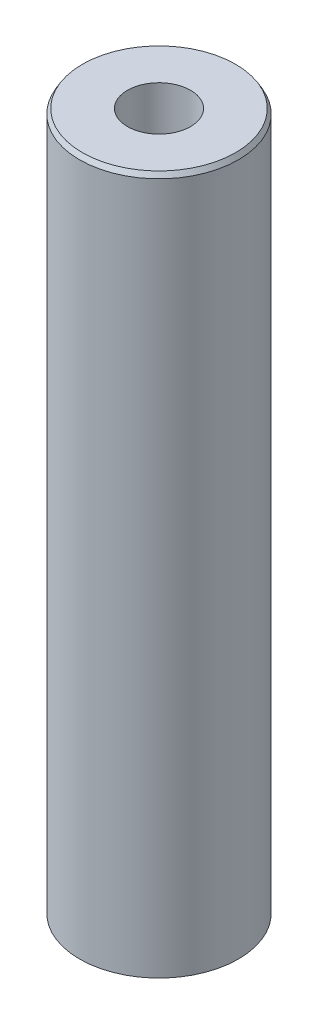
ISO-10303-21;
HEADER;
FILE_DESCRIPTION(('STEP AP214'),'2;1');
FILE_NAME('part.step','',(''),(''),'','','');
FILE_SCHEMA(('AUTOMOTIVE_DESIGN { 1 0 10303 214 1 1 1 1 }'));
ENDSEC;
DATA;
#1=APPLICATION_CONTEXT('core data for automotive mechanical design processes');
#2=APPLICATION_PROTOCOL_DEFINITION('international standard','automotive_design',2000,#1);
#3=PRODUCT_CONTEXT('',#1,'mechanical');
#4=PRODUCT('Part','Part','',(#3));
#5=PRODUCT_RELATED_PRODUCT_CATEGORY('part','',(#4));
#6=PRODUCT_DEFINITION_FORMATION('','',#4);
#7=PRODUCT_DEFINITION_CONTEXT('part definition',#1,'design');
#8=PRODUCT_DEFINITION('design','',#6,#7);
#9=PRODUCT_DEFINITION_SHAPE('','',#8);
#10=(LENGTH_UNIT() NAMED_UNIT(*) SI_UNIT(.MILLI.,.METRE.));
#11=(NAMED_UNIT(*) PLANE_ANGLE_UNIT() SI_UNIT($,.RADIAN.));
#12=(NAMED_UNIT(*) SI_UNIT($,.STERADIAN.) SOLID_ANGLE_UNIT());
#13=UNCERTAINTY_MEASURE_WITH_UNIT(LENGTH_MEASURE(1.E-05),#10,'distance_accuracy_value','');
#14=(GEOMETRIC_REPRESENTATION_CONTEXT(3) GLOBAL_UNCERTAINTY_ASSIGNED_CONTEXT((#13)) GLOBAL_UNIT_ASSIGNED_CONTEXT((#10,
#11,#12)) REPRESENTATION_CONTEXT('',''));
#15=CARTESIAN_POINT('',(0.,0.,0.));
#16=DIRECTION('',(0.,0.,1.));
#17=DIRECTION('',(1.,0.,0.));
#18=AXIS2_PLACEMENT_3D('',#15,#16,#17);
#19=CARTESIAN_POINT('',(0.,418.697580881328,0.));
#20=DIRECTION('',(0.,-1.,0.));
#21=DIRECTION('',(0.,0.,-1.));
#22=AXIS2_PLACEMENT_3D('',#19,#20,#21);
#23=CYLINDRICAL_SURFACE('',#22,47.5);
#24=CARTESIAN_POINT('',(0.,415.809712659782,0.));
#25=DIRECTION('',(0.,1.,0.));
#26=DIRECTION('',(0.,0.,1.));
#27=AXIS2_PLACEMENT_3D('',#24,#25,#26);
#28=CIRCLE('',#27,47.5);
#29=CARTESIAN_POINT('',(0.,415.809712659782,-47.5));
#30=VERTEX_POINT('',#29);
#31=EDGE_CURVE('E50',#30,#30,#28,.F.);
#32=CARTESIAN_POINT('',(0.,1.66731149509403,0.));
#33=DIRECTION('',(0.,1.,0.));
#34=DIRECTION('',(0.,0.,1.));
#35=AXIS2_PLACEMENT_3D('',#32,#33,#34);
#36=CIRCLE('',#35,47.5);
#37=CARTESIAN_POINT('',(0.,1.66731149509397,-47.5));
#38=VERTEX_POINT('',#37);
#39=EDGE_CURVE('E51',#38,#38,#36,.T.);
#40=CARTESIAN_POINT('',(0.,415.809712659782,-47.5));
#41=CARTESIAN_POINT('',(0.,411.495729314317,-47.5));
#42=CARTESIAN_POINT('',(0.,407.181745968851,-47.5));
#43=CARTESIAN_POINT('',(0.,398.55377927792,-47.5));
#44=CARTESIAN_POINT('',(0.,394.239795932455,-47.5));
#45=CARTESIAN_POINT('',(0.,385.611829241524,-47.5));
#46=CARTESIAN_POINT('',(0.,381.297845896058,-47.5));
#47=CARTESIAN_POINT('',(0.,372.669879205127,-47.5));
#48=CARTESIAN_POINT('',(0.,368.355895859662,-47.5));
#49=CARTESIAN_POINT('',(0.,359.727929168731,-47.5));
#50=CARTESIAN_POINT('',(0.,355.413945823265,-47.5));
#51=CARTESIAN_POINT('',(0.,346.785979132334,-47.5));
#52=CARTESIAN_POINT('',(0.,342.471995786869,-47.5));
#53=CARTESIAN_POINT('',(0.,333.844029095938,-47.5));
#54=CARTESIAN_POINT('',(0.,329.530045750472,-47.5));
#55=CARTESIAN_POINT('',(0.,320.902079059541,-47.5));
#56=CARTESIAN_POINT('',(0.,316.588095714076,-47.5));
#57=CARTESIAN_POINT('',(0.,307.960129023145,-47.5));
#58=CARTESIAN_POINT('',(0.,303.646145677679,-47.5));
#59=CARTESIAN_POINT('',(0.,295.018178986748,-47.5));
#60=CARTESIAN_POINT('',(0.,290.704195641283,-47.5));
#61=CARTESIAN_POINT('',(0.,282.076228950352,-47.5));
#62=CARTESIAN_POINT('',(0.,277.762245604886,-47.5));
#63=CARTESIAN_POINT('',(0.,269.134278913955,-47.5));
#64=CARTESIAN_POINT('',(0.,264.82029556849,-47.5));
#65=CARTESIAN_POINT('',(0.,256.192328877559,-47.5));
#66=CARTESIAN_POINT('',(0.,251.878345532093,-47.5));
#67=CARTESIAN_POINT('',(0.,243.250378841162,-47.5));
#68=CARTESIAN_POINT('',(0.,238.936395495697,-47.5));
#69=CARTESIAN_POINT('',(0.,230.308428804766,-47.5));
#70=CARTESIAN_POINT('',(0.,225.9944454593,-47.5));
#71=CARTESIAN_POINT('',(0.,217.366478768369,-47.5));
#72=CARTESIAN_POINT('',(0.,213.052495422904,-47.5));
#73=CARTESIAN_POINT('',(0.,204.424528731973,-47.5));
#74=CARTESIAN_POINT('',(0.,200.110545386507,-47.5));
#75=CARTESIAN_POINT('',(0.,191.482578695576,-47.5));
#76=CARTESIAN_POINT('',(0.,187.168595350111,-47.5));
#77=CARTESIAN_POINT('',(0.,178.54062865918,-47.5));
#78=CARTESIAN_POINT('',(0.,174.226645313714,-47.5));
#79=CARTESIAN_POINT('',(0.,165.598678622783,-47.5));
#80=CARTESIAN_POINT('',(0.,161.284695277318,-47.5));
#81=CARTESIAN_POINT('',(0.,152.656728586387,-47.5));
#82=CARTESIAN_POINT('',(0.,148.342745240921,-47.5));
#83=CARTESIAN_POINT('',(0.,139.71477854999,-47.5));
#84=CARTESIAN_POINT('',(0.,135.400795204525,-47.5));
#85=CARTESIAN_POINT('',(0.,126.772828513594,-47.5));
#86=CARTESIAN_POINT('',(0.,122.458845168128,-47.5));
#87=CARTESIAN_POINT('',(0.,113.830878477197,-47.5));
#88=CARTESIAN_POINT('',(0.,109.516895131732,-47.5));
#89=CARTESIAN_POINT('',(0.,100.888928440801,-47.5));
#90=CARTESIAN_POINT('',(0.,96.574945095335,-47.5));
#91=CARTESIAN_POINT('',(0.,87.946978404404,-47.5));
#92=CARTESIAN_POINT('',(0.,83.6329950589385,-47.5));
#93=CARTESIAN_POINT('',(0.,75.0050283680075,-47.5));
#94=CARTESIAN_POINT('',(0.,70.691045022542,-47.5));
#95=CARTESIAN_POINT('',(0.,62.063078331611,-47.5));
#96=CARTESIAN_POINT('',(0.,57.7490949861455,-47.5));
#97=CARTESIAN_POINT('',(0.,49.1211282952145,-47.5));
#98=CARTESIAN_POINT('',(0.,44.807144949749,-47.5));
#99=CARTESIAN_POINT('',(0.,36.179178258818,-47.5));
#100=CARTESIAN_POINT('',(0.,31.8651949133525,-47.5));
#101=CARTESIAN_POINT('',(0.,23.2372282224215,-47.5));
#102=CARTESIAN_POINT('',(0.,18.923244876956,-47.5));
#103=CARTESIAN_POINT('',(0.,10.295278186025,-47.5));
#104=CARTESIAN_POINT('',(0.,5.98129484055948,-47.5));
#105=CARTESIAN_POINT('',(0.,1.66731149509397,-47.5));
#106=B_SPLINE_CURVE_WITH_KNOTS('',3,(#40,#41,#42,#43,#44,#45,#46,#47,#48,#49,#50,#51,#52,#53,
#54,#55,#56,#57,#58,#59,#60,#61,#62,#63,#64,#65,#66,#67,#68,#69,#70,#71,#72,#73,#74,#75,#76,#77,
#78,#79,#80,#81,#82,#83,#84,#85,#86,#87,#88,#89,#90,#91,#92,#93,#94,#95,#96,#97,#98,#99,#100,
#101,#102,#103,#104,#105),.UNSPECIFIED.,.F.,.F.,(4,2,2,2,2,2,2,2,2,2,2,2,2,2,2,2,2,2,2,2,2,2,2,
2,2,2,2,2,2,2,2,2,4),(0.,12.9419500363965,25.883900072793,38.8258501091895,51.767800145586,
64.7097501819825,77.651700218379,90.5936502547755,103.535600291172,116.477550327569,
129.419500363965,142.361450400362,155.303400436758,168.245350473155,181.187300509551,
194.129250545948,207.071200582344,220.013150618741,232.955100655137,245.897050691534,
258.83900072793,271.780950764327,284.722900800723,297.66485083712,310.606800873516,
323.548750909913,336.490700946309,349.432650982706,362.374601019102,375.316551055499,
388.258501091895,401.200451128292,414.142401164688),.UNSPECIFIED.);
#107=EDGE_CURVE('BSEAM39',#30,#38,#106,.T.);
#108=ORIENTED_EDGE('',*,*,#31,.T.);
#109=ORIENTED_EDGE('',*,*,#39,.T.);
#110=ORIENTED_EDGE('',*,*,#107,.T.);
#111=ORIENTED_EDGE('',*,*,#107,.F.);
#112=EDGE_LOOP('',(#108,#110,#109,#111));
#113=FACE_BOUND('',#112,.T.);
#114=ADVANCED_FACE('F39',(#113),#23,.T.);
#115=CARTESIAN_POINT('',(0.,418.697580881328,0.));
#116=DIRECTION('',(0.,1.,0.));
#117=DIRECTION('',(0.,0.,1.));
#118=AXIS2_PLACEMENT_3D('',#115,#116,#117);
#119=PLANE('',#118);
#120=CARTESIAN_POINT('',(0.,418.697580881328,0.));
#121=DIRECTION('',(0.,1.,0.));
#122=DIRECTION('',(0.,0.,1.));
#123=AXIS2_PLACEMENT_3D('',#120,#121,#122);
#124=CIRCLE('',#123,45.8326885049065);
#125=CARTESIAN_POINT('',(0.,418.697580881328,45.8326885049065));
#126=VERTEX_POINT('',#125);
#127=EDGE_CURVE('E54',#126,#126,#124,.T.);
#128=ORIENTED_EDGE('',*,*,#127,.T.);
#129=EDGE_LOOP('',(#128));
#130=FACE_BOUND('',#129,.T.);
#131=CARTESIAN_POINT('',(0.,418.697580881328,0.));
#132=DIRECTION('',(0.,1.,0.));
#133=DIRECTION('',(0.,0.,1.));
#134=AXIS2_PLACEMENT_3D('',#131,#132,#133);
#135=CIRCLE('',#134,18.8619645591852);
#136=CARTESIAN_POINT('',(0.,418.697580881328,-18.8619645591852));
#137=VERTEX_POINT('',#136);
#138=EDGE_CURVE('E58',#137,#137,#135,.T.);
#139=ORIENTED_EDGE('',*,*,#138,.F.);
#140=EDGE_LOOP('',(#139));
#141=FACE_BOUND('',#140,.T.);
#142=ADVANCED_FACE('F69',(#130,#141),#119,.T.);
#143=CARTESIAN_POINT('',(0.,0.,0.));
#144=DIRECTION('',(0.,1.,0.));
#145=DIRECTION('',(0.,0.,1.));
#146=AXIS2_PLACEMENT_3D('',#143,#144,#145);
#147=PLANE('',#146);
#148=CARTESIAN_POINT('',(0.,0.,0.));
#149=DIRECTION('',(0.,1.,0.));
#150=DIRECTION('',(0.,0.,1.));
#151=AXIS2_PLACEMENT_3D('',#148,#149,#150);
#152=CIRCLE('',#151,44.6121317784535);
#153=CARTESIAN_POINT('',(0.,0.,44.6121317784535));
#154=VERTEX_POINT('',#153);
#155=EDGE_CURVE('E10',#154,#154,#152,.F.);
#156=ORIENTED_EDGE('',*,*,#155,.T.);
#157=EDGE_LOOP('',(#156));
#158=FACE_BOUND('',#157,.T.);
#159=CARTESIAN_POINT('',(0.,0.,0.));
#160=DIRECTION('',(0.,1.,0.));
#161=DIRECTION('',(0.,0.,1.));
#162=AXIS2_PLACEMENT_3D('',#159,#160,#161);
#163=CIRCLE('',#162,18.8619645591852);
#164=CARTESIAN_POINT('',(0.,0.,-18.8619645591852));
#165=VERTEX_POINT('',#164);
#166=EDGE_CURVE('E63',#165,#165,#163,.T.);
#167=ORIENTED_EDGE('',*,*,#166,.T.);
#168=EDGE_LOOP('',(#167));
#169=FACE_BOUND('',#168,.T.);
#170=ADVANCED_FACE('F75',(#158,#169),#147,.F.);
#171=CARTESIAN_POINT('',(0.,418.697580881328,0.));
#172=DIRECTION('',(0.,-1.,0.));
#173=DIRECTION('',(0.,0.,-1.));
#174=AXIS2_PLACEMENT_3D('',#171,#172,#173);
#175=CYLINDRICAL_SURFACE('',#174,18.8619645591852);
#176=CARTESIAN_POINT('',(0.,418.697580881328,-18.8619645591852));
#177=CARTESIAN_POINT('',(0.,414.336147747147,-18.8619645591852));
#178=CARTESIAN_POINT('',(0.,409.974714612967,-18.8619645591852));
#179=CARTESIAN_POINT('',(0.,401.251848344606,-18.8619645591852));
#180=CARTESIAN_POINT('',(0.,396.890415210425,-18.8619645591852));
#181=CARTESIAN_POINT('',(0.,388.167548942064,-18.8619645591852));
#182=CARTESIAN_POINT('',(0.,383.806115807884,-18.8619645591852));
#183=CARTESIAN_POINT('',(0.,375.083249539523,-18.8619645591852));
#184=CARTESIAN_POINT('',(0.,370.721816405342,-18.8619645591852));
#185=CARTESIAN_POINT('',(0.,361.998950136981,-18.8619645591852));
#186=CARTESIAN_POINT('',(0.,357.637517002801,-18.8619645591852));
#187=CARTESIAN_POINT('',(0.,348.91465073444,-18.8619645591852));
#188=CARTESIAN_POINT('',(0.,344.553217600259,-18.8619645591852));
#189=CARTESIAN_POINT('',(0.,335.830351331898,-18.8619645591852));
#190=CARTESIAN_POINT('',(0.,331.468918197718,-18.8619645591852));
#191=CARTESIAN_POINT('',(0.,322.746051929357,-18.8619645591852));
#192=CARTESIAN_POINT('',(0.,318.384618795176,-18.8619645591852));
#193=CARTESIAN_POINT('',(0.,309.661752526815,-18.8619645591852));
#194=CARTESIAN_POINT('',(0.,305.300319392635,-18.8619645591852));
#195=CARTESIAN_POINT('',(0.,296.577453124274,-18.8619645591852));
#196=CARTESIAN_POINT('',(0.,292.216019990093,-18.8619645591852));
#197=CARTESIAN_POINT('',(0.,283.493153721732,-18.8619645591852));
#198=CARTESIAN_POINT('',(0.,279.131720587552,-18.8619645591852));
#199=CARTESIAN_POINT('',(0.,270.408854319191,-18.8619645591852));
#200=CARTESIAN_POINT('',(0.,266.04742118501,-18.8619645591852));
#201=CARTESIAN_POINT('',(0.,257.324554916649,-18.8619645591852));
#202=CARTESIAN_POINT('',(0.,252.963121782469,-18.8619645591852));
#203=CARTESIAN_POINT('',(0.,244.240255514108,-18.8619645591852));
#204=CARTESIAN_POINT('',(0.,239.878822379927,-18.8619645591852));
#205=CARTESIAN_POINT('',(0.,231.155956111566,-18.8619645591852));
#206=CARTESIAN_POINT('',(0.,226.794522977386,-18.8619645591852));
#207=CARTESIAN_POINT('',(0.,218.071656709025,-18.8619645591852));
#208=CARTESIAN_POINT('',(0.,213.710223574844,-18.8619645591852));
#209=CARTESIAN_POINT('',(0.,204.987357306483,-18.8619645591852));
#210=CARTESIAN_POINT('',(0.,200.625924172303,-18.8619645591852));
#211=CARTESIAN_POINT('',(0.,191.903057903942,-18.8619645591852));
#212=CARTESIAN_POINT('',(0.,187.541624769761,-18.8619645591852));
#213=CARTESIAN_POINT('',(0.,178.8187585014,-18.8619645591852));
#214=CARTESIAN_POINT('',(0.,174.45732536722,-18.8619645591852));
#215=CARTESIAN_POINT('',(0.,165.734459098859,-18.8619645591852));
#216=CARTESIAN_POINT('',(0.,161.373025964678,-18.8619645591852));
#217=CARTESIAN_POINT('',(0.,152.650159696317,-18.8619645591852));
#218=CARTESIAN_POINT('',(0.,148.288726562137,-18.8619645591852));
#219=CARTESIAN_POINT('',(0.,139.565860293776,-18.8619645591852));
#220=CARTESIAN_POINT('',(0.,135.204427159595,-18.8619645591852));
#221=CARTESIAN_POINT('',(0.,126.481560891234,-18.8619645591852));
#222=CARTESIAN_POINT('',(0.,122.120127757054,-18.8619645591852));
#223=CARTESIAN_POINT('',(0.,113.397261488693,-18.8619645591852));
#224=CARTESIAN_POINT('',(0.,109.035828354512,-18.8619645591852));
#225=CARTESIAN_POINT('',(0.,100.312962086151,-18.8619645591852));
#226=CARTESIAN_POINT('',(0.,95.9515289519709,-18.8619645591852));
#227=CARTESIAN_POINT('',(0.,87.2286626836099,-18.8619645591852));
#228=CARTESIAN_POINT('',(0.,82.8672295494295,-18.8619645591852));
#229=CARTESIAN_POINT('',(0.,74.1443632810685,-18.8619645591852));
#230=CARTESIAN_POINT('',(0.,69.7829301468879,-18.8619645591852));
#231=CARTESIAN_POINT('',(0.,61.0600638785269,-18.8619645591852));
#232=CARTESIAN_POINT('',(0.,56.6986307443464,-18.8619645591852));
#233=CARTESIAN_POINT('',(0.,47.9757644759854,-18.8619645591852));
#234=CARTESIAN_POINT('',(0.,43.6143313418049,-18.8619645591852));
#235=CARTESIAN_POINT('',(0.,34.8914650734439,-18.8619645591852));
#236=CARTESIAN_POINT('',(0.,30.5300319392634,-18.8619645591852));
#237=CARTESIAN_POINT('',(0.,21.8071656709024,-18.8619645591852));
#238=CARTESIAN_POINT('',(0.,17.445732536722,-18.8619645591852));
#239=CARTESIAN_POINT('',(0.,8.72286626836096,-18.8619645591852));
#240=CARTESIAN_POINT('',(0.,4.36143313418045,-18.8619645591852));
#241=CARTESIAN_POINT('',(0.,0.,-18.8619645591852));
#242=B_SPLINE_CURVE_WITH_KNOTS('',3,(#176,#177,#178,#179,#180,#181,#182,#183,#184,#185,#186,
#187,#188,#189,#190,#191,#192,#193,#194,#195,#196,#197,#198,#199,#200,#201,#202,#203,#204,#205,
#206,#207,#208,#209,#210,#211,#212,#213,#214,#215,#216,#217,#218,#219,#220,#221,#222,#223,#224,
#225,#226,#227,#228,#229,#230,#231,#232,#233,#234,#235,#236,#237,#238,#239,#240,#241),
.UNSPECIFIED.,.F.,.F.,(4,2,2,2,2,2,2,2,2,2,2,2,2,2,2,2,2,2,2,2,2,2,2,2,2,2,2,2,2,2,2,2,4),(0.,
13.0842994025415,26.168598805083,39.2528982076245,52.337197610166,65.4214970127074,
78.505796415249,91.5900958177905,104.674395220332,117.758694622873,130.842994025415,
143.927293427956,157.011592830498,170.095892233039,183.180191635581,196.264491038122,
209.348790440664,222.433089843205,235.517389245747,248.601688648288,261.68598805083,
274.770287453371,287.854586855913,300.938886258454,314.023185660996,327.107485063537,
340.191784466079,353.27608386862,366.360383271162,379.444682673703,392.528982076245,
405.613281478786,418.697580881328),.UNSPECIFIED.);
#243=EDGE_CURVE('BSEAM70',#137,#165,#242,.T.);
#244=ORIENTED_EDGE('',*,*,#138,.T.);
#245=ORIENTED_EDGE('',*,*,#166,.F.);
#246=ORIENTED_EDGE('',*,*,#243,.T.);
#247=ORIENTED_EDGE('',*,*,#243,.F.);
#248=EDGE_LOOP('',(#244,#246,#245,#247));
#249=FACE_BOUND('',#248,.T.);
#250=ADVANCED_FACE('F70',(#249),#175,.F.);
#251=CARTESIAN_POINT('',(0.,418.697580881328,0.));
#252=DIRECTION('',(0.,-1.,0.));
#253=DIRECTION('',(0.,0.,-1.));
#254=AXIS2_PLACEMENT_3D('',#251,#252,#253);
#255=CONICAL_SURFACE('',#254,45.8326885049065,0.523598775598287);
#256=ORIENTED_EDGE('',*,*,#31,.F.);
#257=EDGE_LOOP('',(#256));
#258=FACE_BOUND('',#257,.T.);
#259=ORIENTED_EDGE('',*,*,#127,.F.);
#260=EDGE_LOOP('',(#259));
#261=FACE_BOUND('',#260,.T.);
#262=ADVANCED_FACE('F81',(#258,#261),#255,.T.);
#263=CARTESIAN_POINT('',(0.,1.66731149509403,0.));
#264=DIRECTION('',(0.,1.,0.));
#265=DIRECTION('',(0.,0.,1.));
#266=AXIS2_PLACEMENT_3D('',#263,#264,#265);
#267=CONICAL_SURFACE('',#266,47.5,1.04719755119661);
#268=ORIENTED_EDGE('',*,*,#155,.F.);
#269=EDGE_LOOP('',(#268));
#270=FACE_BOUND('',#269,.T.);
#271=ORIENTED_EDGE('',*,*,#39,.F.);
#272=EDGE_LOOP('',(#271));
#273=FACE_BOUND('',#272,.T.);
#274=ADVANCED_FACE('F45',(#270,#273),#267,.T.);
#275=CLOSED_SHELL('',(#114,#142,#170,#250,#262,#274));
#276=MANIFOLD_SOLID_BREP('B2',#275);
#277=ADVANCED_BREP_SHAPE_REPRESENTATION('',(#18,#276),#14);
#278=SHAPE_DEFINITION_REPRESENTATION(#9,#277);
ENDSEC;
END-ISO-10303-21;
